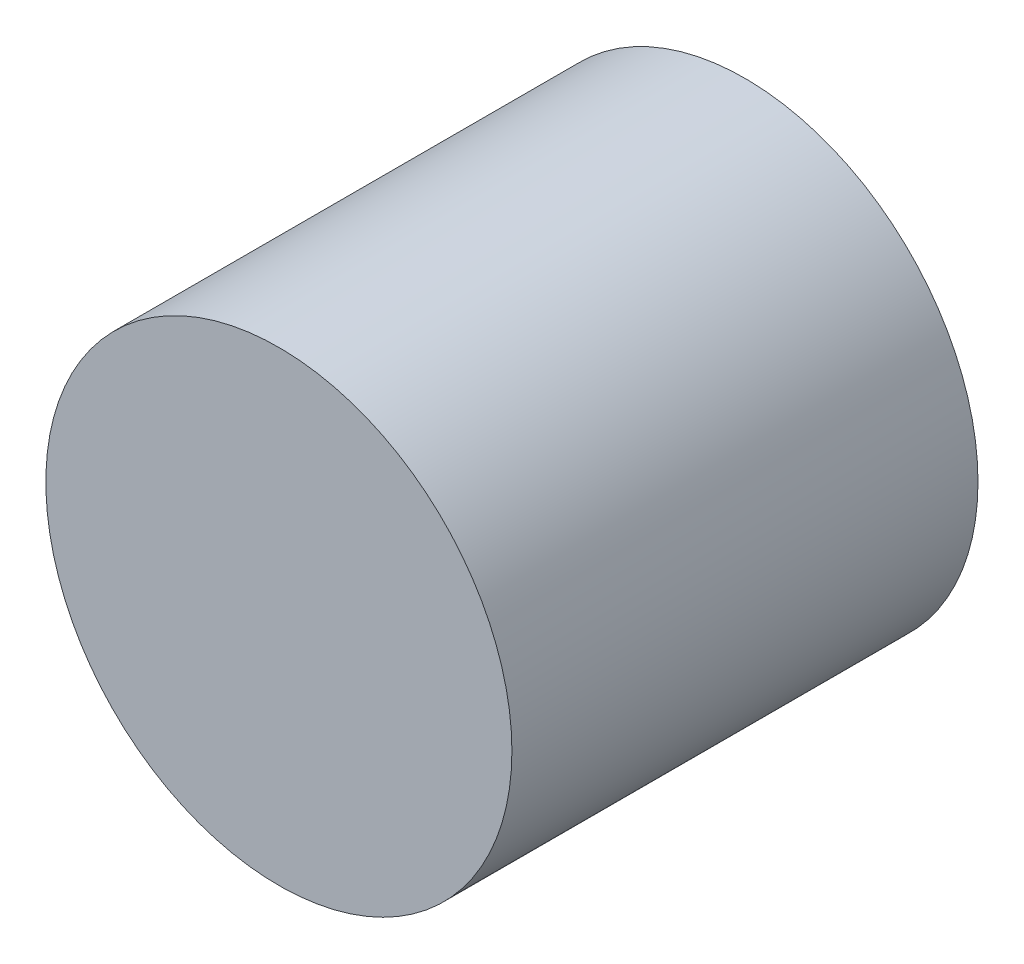
ISO-10303-21;
HEADER;
FILE_DESCRIPTION(('STEP AP214'),'2;1');
FILE_NAME('part.step','',(''),(''),'','','');
FILE_SCHEMA(('AUTOMOTIVE_DESIGN { 1 0 10303 214 1 1 1 1 }'));
ENDSEC;
DATA;
#1=APPLICATION_CONTEXT('core data for automotive mechanical design processes');
#2=APPLICATION_PROTOCOL_DEFINITION('international standard','automotive_design',2000,#1);
#3=PRODUCT_CONTEXT('',#1,'mechanical');
#4=PRODUCT('Part','Part','',(#3));
#5=PRODUCT_RELATED_PRODUCT_CATEGORY('part','',(#4));
#6=PRODUCT_DEFINITION_FORMATION('','',#4);
#7=PRODUCT_DEFINITION_CONTEXT('part definition',#1,'design');
#8=PRODUCT_DEFINITION('design','',#6,#7);
#9=PRODUCT_DEFINITION_SHAPE('','',#8);
#10=(LENGTH_UNIT() NAMED_UNIT(*) SI_UNIT(.MILLI.,.METRE.));
#11=(NAMED_UNIT(*) PLANE_ANGLE_UNIT() SI_UNIT($,.RADIAN.));
#12=(NAMED_UNIT(*) SI_UNIT($,.STERADIAN.) SOLID_ANGLE_UNIT());
#13=UNCERTAINTY_MEASURE_WITH_UNIT(LENGTH_MEASURE(1.E-05),#10,'distance_accuracy_value','');
#14=(GEOMETRIC_REPRESENTATION_CONTEXT(3) GLOBAL_UNCERTAINTY_ASSIGNED_CONTEXT((#13)) GLOBAL_UNIT_ASSIGNED_CONTEXT((#10,
#11,#12)) REPRESENTATION_CONTEXT('',''));
#15=CARTESIAN_POINT('',(0.,0.,0.));
#16=DIRECTION('',(0.,0.,1.));
#17=DIRECTION('',(1.,0.,0.));
#18=AXIS2_PLACEMENT_3D('',#15,#16,#17);
#19=CARTESIAN_POINT('',(2.63867667905449,20.8455457645301,40.64));
#20=DIRECTION('',(0.,0.,-1.));
#21=DIRECTION('',(-1.,0.,0.));
#22=AXIS2_PLACEMENT_3D('',#19,#20,#21);
#23=CYLINDRICAL_SURFACE('',#22,20.32);
#24=CARTESIAN_POINT('',(2.63867667905449,20.8455457645301,40.64));
#25=DIRECTION('',(0.,0.,1.));
#26=DIRECTION('',(1.,0.,0.));
#27=AXIS2_PLACEMENT_3D('',#24,#25,#26);
#28=CIRCLE('',#27,20.32);
#29=CARTESIAN_POINT('',(22.9586766790545,20.8455457645301,40.64));
#30=VERTEX_POINT('',#29);
#31=EDGE_CURVE('E10',#30,#30,#28,.T.);
#32=ORIENTED_EDGE('',*,*,#31,.F.);
#33=EDGE_LOOP('',(#32));
#34=FACE_BOUND('',#33,.T.);
#35=CARTESIAN_POINT('',(2.63867667905449,20.8455457645301,0.));
#36=DIRECTION('',(0.,0.,1.));
#37=DIRECTION('',(1.,0.,0.));
#38=AXIS2_PLACEMENT_3D('',#35,#36,#37);
#39=CIRCLE('',#38,20.32);
#40=CARTESIAN_POINT('',(22.9586766790545,20.8455457645301,0.));
#41=VERTEX_POINT('',#40);
#42=EDGE_CURVE('E34',#41,#41,#39,.T.);
#43=ORIENTED_EDGE('',*,*,#42,.T.);
#44=EDGE_LOOP('',(#43));
#45=FACE_BOUND('',#44,.T.);
#46=ADVANCED_FACE('F31',(#34,#45),#23,.T.);
#47=CARTESIAN_POINT('',(2.63867667905449,20.8455457645301,40.64));
#48=DIRECTION('',(0.,0.,1.));
#49=DIRECTION('',(1.,0.,0.));
#50=AXIS2_PLACEMENT_3D('',#47,#48,#49);
#51=PLANE('',#50);
#52=ORIENTED_EDGE('',*,*,#31,.T.);
#53=EDGE_LOOP('',(#52));
#54=FACE_BOUND('',#53,.T.);
#55=ADVANCED_FACE('F46',(#54),#51,.T.);
#56=CARTESIAN_POINT('',(2.63867667905449,20.8455457645301,0.));
#57=DIRECTION('',(0.,0.,1.));
#58=DIRECTION('',(1.,0.,0.));
#59=AXIS2_PLACEMENT_3D('',#56,#57,#58);
#60=PLANE('',#59);
#61=ORIENTED_EDGE('',*,*,#42,.F.);
#62=EDGE_LOOP('',(#61));
#63=FACE_BOUND('',#62,.T.);
#64=ADVANCED_FACE('F44',(#63),#60,.F.);
#65=CLOSED_SHELL('',(#46,#55,#64));
#66=MANIFOLD_SOLID_BREP('B2',#65);
#67=ADVANCED_BREP_SHAPE_REPRESENTATION('',(#18,#66),#14);
#68=SHAPE_DEFINITION_REPRESENTATION(#9,#67);
ENDSEC;
END-ISO-10303-21;
